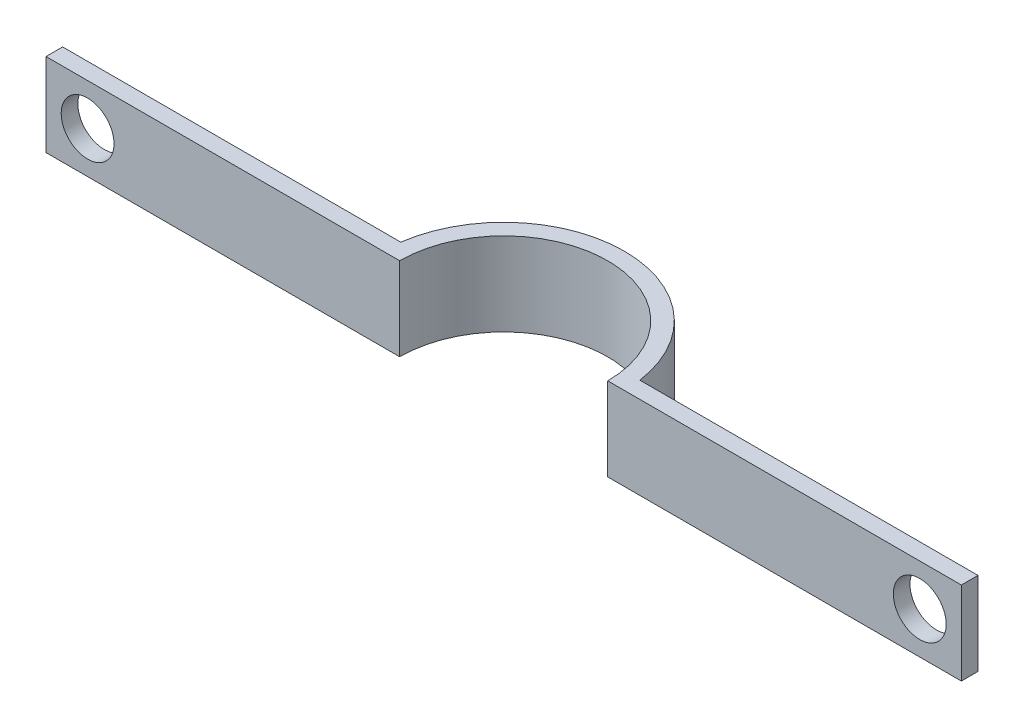
ISO-10303-21;
HEADER;
FILE_DESCRIPTION(('STEP AP214'),'2;1');
FILE_NAME('part.step','',(''),(''),'','','');
FILE_SCHEMA(('AUTOMOTIVE_DESIGN { 1 0 10303 214 1 1 1 1 }'));
ENDSEC;
DATA;
#1=APPLICATION_CONTEXT('core data for automotive mechanical design processes');
#2=APPLICATION_PROTOCOL_DEFINITION('international standard','automotive_design',2000,#1);
#3=PRODUCT_CONTEXT('',#1,'mechanical');
#4=PRODUCT('Part','Part','',(#3));
#5=PRODUCT_RELATED_PRODUCT_CATEGORY('part','',(#4));
#6=PRODUCT_DEFINITION_FORMATION('','',#4);
#7=PRODUCT_DEFINITION_CONTEXT('part definition',#1,'design');
#8=PRODUCT_DEFINITION('design','',#6,#7);
#9=PRODUCT_DEFINITION_SHAPE('','',#8);
#10=(LENGTH_UNIT() NAMED_UNIT(*) SI_UNIT(.MILLI.,.METRE.));
#11=(NAMED_UNIT(*) PLANE_ANGLE_UNIT() SI_UNIT($,.RADIAN.));
#12=(NAMED_UNIT(*) SI_UNIT($,.STERADIAN.) SOLID_ANGLE_UNIT());
#13=UNCERTAINTY_MEASURE_WITH_UNIT(LENGTH_MEASURE(1.E-05),#10,'distance_accuracy_value','');
#14=(GEOMETRIC_REPRESENTATION_CONTEXT(3) GLOBAL_UNCERTAINTY_ASSIGNED_CONTEXT((#13)) GLOBAL_UNIT_ASSIGNED_CONTEXT((#10,
#11,#12)) REPRESENTATION_CONTEXT('',''));
#15=CARTESIAN_POINT('',(0.,0.,0.));
#16=DIRECTION('',(0.,0.,1.));
#17=DIRECTION('',(1.,0.,0.));
#18=AXIS2_PLACEMENT_3D('',#15,#16,#17);
#19=CARTESIAN_POINT('',(220.,15.,11.2649567794205));
#20=DIRECTION('',(0.,0.,1.));
#21=DIRECTION('',(1.,0.,0.));
#22=AXIS2_PLACEMENT_3D('',#19,#20,#21);
#23=PLANE('',#22);
#24=DIRECTION('',(0.,-1.,0.));
#25=VECTOR('',#24,1.);
#26=CARTESIAN_POINT('',(-50.,-25.,11.2649567794205));
#27=LINE('',#26,#25);
#28=CARTESIAN_POINT('',(-50.,15.,11.2649567794205));
#29=VERTEX_POINT('',#28);
#30=CARTESIAN_POINT('',(-50.,-25.,11.2649567794205));
#31=VERTEX_POINT('',#30);
#32=EDGE_CURVE('E11',#29,#31,#27,.T.);
#33=ORIENTED_EDGE('',*,*,#32,.F.);
#34=DIRECTION('',(-1.,0.,0.));
#35=VECTOR('',#34,1.);
#36=CARTESIAN_POINT('',(220.,15.,11.2649567794205));
#37=LINE('',#36,#35);
#38=CARTESIAN_POINT('',(-220.,15.,11.2649567794205));
#39=VERTEX_POINT('',#38);
#40=EDGE_CURVE('E177',#29,#39,#37,.T.);
#41=ORIENTED_EDGE('',*,*,#40,.T.);
#42=DIRECTION('',(0.,-1.,0.));
#43=VECTOR('',#42,1.);
#44=CARTESIAN_POINT('',(-220.,15.,11.2649567794205));
#45=LINE('',#44,#43);
#46=CARTESIAN_POINT('',(-220.,-25.,11.2649567794205));
#47=VERTEX_POINT('',#46);
#48=EDGE_CURVE('E157',#39,#47,#45,.T.);
#49=ORIENTED_EDGE('',*,*,#48,.T.);
#50=DIRECTION('',(-1.,0.,0.));
#51=VECTOR('',#50,1.);
#52=CARTESIAN_POINT('',(220.,-25.,11.2649567794205));
#53=LINE('',#52,#51);
#54=EDGE_CURVE('E138',#31,#47,#53,.T.);
#55=ORIENTED_EDGE('',*,*,#54,.F.);
#56=EDGE_LOOP('',(#33,#41,#49,#55));
#57=FACE_BOUND('',#56,.T.);
#58=CARTESIAN_POINT('',(-200.,-5.00000000000001,11.2649567794206));
#59=DIRECTION('',(0.,0.,-1.));
#60=DIRECTION('',(-1.,0.,0.));
#61=AXIS2_PLACEMENT_3D('',#58,#59,#60);
#62=CIRCLE('',#61,12.7);
#63=CARTESIAN_POINT('',(-212.7,-5.00000000000001,11.2649567794206));
#64=VERTEX_POINT('',#63);
#65=EDGE_CURVE('E139',#64,#64,#62,.T.);
#66=ORIENTED_EDGE('',*,*,#65,.T.);
#67=EDGE_LOOP('',(#66));
#68=FACE_BOUND('',#67,.T.);
#69=ADVANCED_FACE('F35',(#57,#68),#23,.T.);
#70=CARTESIAN_POINT('',(220.,15.,3.26495677942058));
#71=DIRECTION('',(1.,0.,0.));
#72=DIRECTION('',(0.,0.,-1.));
#73=AXIS2_PLACEMENT_3D('',#70,#71,#72);
#74=PLANE('',#73);
#75=DIRECTION('',(0.,0.,1.));
#76=VECTOR('',#75,1.);
#77=CARTESIAN_POINT('',(220.,-25.,3.26495677942058));
#78=LINE('',#77,#76);
#79=CARTESIAN_POINT('',(220.,-25.,3.26495677942058));
#80=VERTEX_POINT('',#79);
#81=CARTESIAN_POINT('',(220.,-25.,11.2649567794205));
#82=VERTEX_POINT('',#81);
#83=EDGE_CURVE('E135',#80,#82,#78,.T.);
#84=ORIENTED_EDGE('',*,*,#83,.F.);
#85=DIRECTION('',(0.,-1.,0.));
#86=VECTOR('',#85,1.);
#87=CARTESIAN_POINT('',(220.,15.,3.26495677942058));
#88=LINE('',#87,#86);
#89=CARTESIAN_POINT('',(220.,15.,3.26495677942058));
#90=VERTEX_POINT('',#89);
#91=EDGE_CURVE('E58',#90,#80,#88,.T.);
#92=ORIENTED_EDGE('',*,*,#91,.F.);
#93=DIRECTION('',(0.,0.,1.));
#94=VECTOR('',#93,1.);
#95=CARTESIAN_POINT('',(220.,15.,3.26495677942058));
#96=LINE('',#95,#94);
#97=CARTESIAN_POINT('',(220.,15.,11.2649567794205));
#98=VERTEX_POINT('',#97);
#99=EDGE_CURVE('E152',#90,#98,#96,.T.);
#100=ORIENTED_EDGE('',*,*,#99,.T.);
#101=DIRECTION('',(0.,-1.,0.));
#102=VECTOR('',#101,1.);
#103=CARTESIAN_POINT('',(220.,15.,11.2649567794205));
#104=LINE('',#103,#102);
#105=EDGE_CURVE('E91',#98,#82,#104,.T.);
#106=ORIENTED_EDGE('',*,*,#105,.T.);
#107=EDGE_LOOP('',(#84,#92,#100,#106));
#108=FACE_BOUND('',#107,.T.);
#109=ADVANCED_FACE('F37',(#108),#74,.T.);
#110=CARTESIAN_POINT('',(57.4456264653803,15.,3.26495677942055));
#111=DIRECTION('',(0.,0.,-1.));
#112=DIRECTION('',(-1.,0.,0.));
#113=AXIS2_PLACEMENT_3D('',#110,#111,#112);
#114=PLANE('',#113);
#115=CARTESIAN_POINT('',(200.,-5.,3.26495677942057));
#116=DIRECTION('',(0.,0.,-1.));
#117=DIRECTION('',(-1.,0.,0.));
#118=AXIS2_PLACEMENT_3D('',#115,#116,#117);
#119=CIRCLE('',#118,12.7);
#120=CARTESIAN_POINT('',(187.3,-5.,3.26495677942057));
#121=VERTEX_POINT('',#120);
#122=EDGE_CURVE('E166',#121,#121,#119,.T.);
#123=ORIENTED_EDGE('',*,*,#122,.F.);
#124=EDGE_LOOP('',(#123));
#125=FACE_BOUND('',#124,.T.);
#126=DIRECTION('',(1.,0.,0.));
#127=VECTOR('',#126,1.);
#128=CARTESIAN_POINT('',(57.4456264653803,-25.,3.26495677942055));
#129=LINE('',#128,#127);
#130=CARTESIAN_POINT('',(57.4456264653803,-25.,3.26495677942053));
#131=VERTEX_POINT('',#130);
#132=EDGE_CURVE('E149',#131,#80,#129,.T.);
#133=ORIENTED_EDGE('',*,*,#132,.F.);
#134=DIRECTION('',(0.,-1.,0.));
#135=VECTOR('',#134,1.);
#136=CARTESIAN_POINT('',(57.4456264653803,15.,3.26495677942053));
#137=LINE('',#136,#135);
#138=CARTESIAN_POINT('',(57.4456264653803,15.,3.26495677942053));
#139=VERTEX_POINT('',#138);
#140=EDGE_CURVE('E115',#139,#131,#137,.T.);
#141=ORIENTED_EDGE('',*,*,#140,.F.);
#142=DIRECTION('',(1.,0.,0.));
#143=VECTOR('',#142,1.);
#144=CARTESIAN_POINT('',(57.4456264653803,15.,3.26495677942055));
#145=LINE('',#144,#143);
#146=EDGE_CURVE('E125',#139,#90,#145,.T.);
#147=ORIENTED_EDGE('',*,*,#146,.T.);
#148=ORIENTED_EDGE('',*,*,#91,.T.);
#149=EDGE_LOOP('',(#133,#141,#147,#148));
#150=FACE_BOUND('',#149,.T.);
#151=ADVANCED_FACE('F193',(#125,#150),#114,.T.);
#152=CARTESIAN_POINT('',(0.,15.,11.2649567794205));
#153=DIRECTION('',(0.,-1.,0.));
#154=DIRECTION('',(0.,0.,-1.));
#155=AXIS2_PLACEMENT_3D('',#152,#153,#154);
#156=CYLINDRICAL_SURFACE('',#155,58.);
#157=CARTESIAN_POINT('',(0.,-25.,11.2649567794205));
#158=DIRECTION('',(0.,-1.,0.));
#159=DIRECTION('',(0.,0.,-1.));
#160=AXIS2_PLACEMENT_3D('',#157,#158,#159);
#161=CIRCLE('',#160,58.);
#162=CARTESIAN_POINT('',(-57.4456264653803,-25.,3.26495677942058));
#163=VERTEX_POINT('',#162);
#164=EDGE_CURVE('E110',#163,#131,#161,.T.);
#165=ORIENTED_EDGE('',*,*,#164,.F.);
#166=DIRECTION('',(0.,-1.,0.));
#167=VECTOR('',#166,1.);
#168=CARTESIAN_POINT('',(-57.4456264653803,15.,3.26495677942058));
#169=LINE('',#168,#167);
#170=CARTESIAN_POINT('',(-57.4456264653803,15.,3.26495677942058));
#171=VERTEX_POINT('',#170);
#172=EDGE_CURVE('E104',#171,#163,#169,.T.);
#173=ORIENTED_EDGE('',*,*,#172,.F.);
#174=CARTESIAN_POINT('',(0.,15.,11.2649567794205));
#175=DIRECTION('',(0.,-1.,0.));
#176=DIRECTION('',(0.,0.,-1.));
#177=AXIS2_PLACEMENT_3D('',#174,#175,#176);
#178=CIRCLE('',#177,58.);
#179=EDGE_CURVE('E107',#171,#139,#178,.T.);
#180=ORIENTED_EDGE('',*,*,#179,.T.);
#181=ORIENTED_EDGE('',*,*,#140,.T.);
#182=EDGE_LOOP('',(#165,#173,#180,#181));
#183=FACE_BOUND('',#182,.T.);
#184=ADVANCED_FACE('F106',(#183),#156,.T.);
#185=CARTESIAN_POINT('',(-220.,15.,3.26495677942055));
#186=DIRECTION('',(0.,0.,-1.));
#187=DIRECTION('',(-1.,0.,0.));
#188=AXIS2_PLACEMENT_3D('',#185,#186,#187);
#189=PLANE('',#188);
#190=CARTESIAN_POINT('',(-200.,-5.00000000000001,3.26495677942049));
#191=DIRECTION('',(0.,0.,-1.));
#192=DIRECTION('',(-1.,0.,0.));
#193=AXIS2_PLACEMENT_3D('',#190,#191,#192);
#194=CIRCLE('',#193,12.7);
#195=CARTESIAN_POINT('',(-212.7,-5.00000000000001,3.26495677942049));
#196=VERTEX_POINT('',#195);
#197=EDGE_CURVE('E172',#196,#196,#194,.T.);
#198=ORIENTED_EDGE('',*,*,#197,.F.);
#199=EDGE_LOOP('',(#198));
#200=FACE_BOUND('',#199,.T.);
#201=DIRECTION('',(1.,0.,0.));
#202=VECTOR('',#201,1.);
#203=CARTESIAN_POINT('',(-220.,-25.,3.26495677942055));
#204=LINE('',#203,#202);
#205=CARTESIAN_POINT('',(-220.,-25.,3.26495677942055));
#206=VERTEX_POINT('',#205);
#207=EDGE_CURVE('E146',#206,#163,#204,.T.);
#208=ORIENTED_EDGE('',*,*,#207,.F.);
#209=DIRECTION('',(0.,-1.,0.));
#210=VECTOR('',#209,1.);
#211=CARTESIAN_POINT('',(-220.,15.,3.26495677942055));
#212=LINE('',#211,#210);
#213=CARTESIAN_POINT('',(-220.,15.,3.26495677942055));
#214=VERTEX_POINT('',#213);
#215=EDGE_CURVE('E116',#214,#206,#212,.T.);
#216=ORIENTED_EDGE('',*,*,#215,.F.);
#217=DIRECTION('',(1.,0.,0.));
#218=VECTOR('',#217,1.);
#219=CARTESIAN_POINT('',(-220.,15.,3.26495677942055));
#220=LINE('',#219,#218);
#221=EDGE_CURVE('E123',#214,#171,#220,.T.);
#222=ORIENTED_EDGE('',*,*,#221,.T.);
#223=ORIENTED_EDGE('',*,*,#172,.T.);
#224=EDGE_LOOP('',(#208,#216,#222,#223));
#225=FACE_BOUND('',#224,.T.);
#226=ADVANCED_FACE('F127',(#200,#225),#189,.T.);
#227=CARTESIAN_POINT('',(-220.,15.,11.2649567794205));
#228=DIRECTION('',(-1.,0.,0.));
#229=DIRECTION('',(0.,0.,1.));
#230=AXIS2_PLACEMENT_3D('',#227,#228,#229);
#231=PLANE('',#230);
#232=DIRECTION('',(0.,0.,-1.));
#233=VECTOR('',#232,1.);
#234=CARTESIAN_POINT('',(-220.,-25.,11.2649567794205));
#235=LINE('',#234,#233);
#236=EDGE_CURVE('E143',#47,#206,#235,.T.);
#237=ORIENTED_EDGE('',*,*,#236,.F.);
#238=ORIENTED_EDGE('',*,*,#48,.F.);
#239=DIRECTION('',(0.,0.,-1.));
#240=VECTOR('',#239,1.);
#241=CARTESIAN_POINT('',(-220.,15.,11.2649567794205));
#242=LINE('',#241,#240);
#243=EDGE_CURVE('E128',#39,#214,#242,.T.);
#244=ORIENTED_EDGE('',*,*,#243,.T.);
#245=ORIENTED_EDGE('',*,*,#215,.T.);
#246=EDGE_LOOP('',(#237,#238,#244,#245));
#247=FACE_BOUND('',#246,.T.);
#248=ADVANCED_FACE('F186',(#247),#231,.T.);
#249=DIRECTION('',(0.,-1.,0.));
#250=VECTOR('',#249,1.);
#251=CARTESIAN_POINT('',(50.,-25.,11.2649567794205));
#252=LINE('',#251,#250);
#253=CARTESIAN_POINT('',(50.,-25.,11.2649567794205));
#254=VERTEX_POINT('',#253);
#255=CARTESIAN_POINT('',(50.,15.,11.2649567794205));
#256=VERTEX_POINT('',#255);
#257=EDGE_CURVE('E43',#254,#256,#252,.F.);
#258=ORIENTED_EDGE('',*,*,#257,.F.);
#259=EDGE_CURVE('E140',#82,#254,#53,.T.);
#260=ORIENTED_EDGE('',*,*,#259,.F.);
#261=ORIENTED_EDGE('',*,*,#105,.F.);
#262=EDGE_CURVE('E130',#98,#256,#37,.T.);
#263=ORIENTED_EDGE('',*,*,#262,.T.);
#264=EDGE_LOOP('',(#258,#260,#261,#263));
#265=FACE_BOUND('',#264,.T.);
#266=CARTESIAN_POINT('',(200.,-5.,11.2649567794206));
#267=DIRECTION('',(0.,0.,-1.));
#268=DIRECTION('',(-1.,0.,0.));
#269=AXIS2_PLACEMENT_3D('',#266,#267,#268);
#270=CIRCLE('',#269,12.7);
#271=CARTESIAN_POINT('',(187.3,-5.,11.2649567794206));
#272=VERTEX_POINT('',#271);
#273=EDGE_CURVE('E169',#272,#272,#270,.T.);
#274=ORIENTED_EDGE('',*,*,#273,.T.);
#275=EDGE_LOOP('',(#274));
#276=FACE_BOUND('',#275,.T.);
#277=ADVANCED_FACE('F191',(#265,#276),#23,.T.);
#278=CARTESIAN_POINT('',(0.,15.,11.2649567794205));
#279=DIRECTION('',(0.,-1.,0.));
#280=DIRECTION('',(0.,0.,-1.));
#281=AXIS2_PLACEMENT_3D('',#278,#279,#280);
#282=PLANE('',#281);
#283=ORIENTED_EDGE('',*,*,#40,.F.);
#284=CARTESIAN_POINT('',(0.,15.,11.2649567794205));
#285=DIRECTION('',(0.,-1.,0.));
#286=DIRECTION('',(0.,0.,-1.));
#287=AXIS2_PLACEMENT_3D('',#284,#285,#286);
#288=CIRCLE('',#287,50.);
#289=EDGE_CURVE('E154',#29,#256,#288,.T.);
#290=ORIENTED_EDGE('',*,*,#289,.T.);
#291=ORIENTED_EDGE('',*,*,#262,.F.);
#292=ORIENTED_EDGE('',*,*,#99,.F.);
#293=ORIENTED_EDGE('',*,*,#146,.F.);
#294=ORIENTED_EDGE('',*,*,#179,.F.);
#295=ORIENTED_EDGE('',*,*,#221,.F.);
#296=ORIENTED_EDGE('',*,*,#243,.F.);
#297=EDGE_LOOP('',(#283,#290,#291,#292,#293,#294,#295,#296));
#298=FACE_BOUND('',#297,.T.);
#299=ADVANCED_FACE('F121',(#298),#282,.F.);
#300=CARTESIAN_POINT('',(0.,-25.,11.2649567794205));
#301=DIRECTION('',(0.,-1.,0.));
#302=DIRECTION('',(0.,0.,-1.));
#303=AXIS2_PLACEMENT_3D('',#300,#301,#302);
#304=PLANE('',#303);
#305=CARTESIAN_POINT('',(0.,-25.,11.2649567794205));
#306=DIRECTION('',(0.,-1.,0.));
#307=DIRECTION('',(0.,0.,-1.));
#308=AXIS2_PLACEMENT_3D('',#305,#306,#307);
#309=CIRCLE('',#308,50.);
#310=EDGE_CURVE('E160',#31,#254,#309,.T.);
#311=ORIENTED_EDGE('',*,*,#310,.F.);
#312=ORIENTED_EDGE('',*,*,#54,.T.);
#313=ORIENTED_EDGE('',*,*,#236,.T.);
#314=ORIENTED_EDGE('',*,*,#207,.T.);
#315=ORIENTED_EDGE('',*,*,#164,.T.);
#316=ORIENTED_EDGE('',*,*,#132,.T.);
#317=ORIENTED_EDGE('',*,*,#83,.T.);
#318=ORIENTED_EDGE('',*,*,#259,.T.);
#319=EDGE_LOOP('',(#311,#312,#313,#314,#315,#316,#317,#318));
#320=FACE_BOUND('',#319,.T.);
#321=ADVANCED_FACE('F188',(#320),#304,.T.);
#322=CARTESIAN_POINT('',(-200.,-5.00000000000001,3.26495677942049));
#323=DIRECTION('',(0.,0.,-1.));
#324=DIRECTION('',(-1.,0.,0.));
#325=AXIS2_PLACEMENT_3D('',#322,#323,#324);
#326=CYLINDRICAL_SURFACE('',#325,12.7);
#327=ORIENTED_EDGE('',*,*,#65,.F.);
#328=EDGE_LOOP('',(#327));
#329=FACE_BOUND('',#328,.T.);
#330=ORIENTED_EDGE('',*,*,#197,.T.);
#331=EDGE_LOOP('',(#330));
#332=FACE_BOUND('',#331,.T.);
#333=ADVANCED_FACE('F223',(#329,#332),#326,.F.);
#334=CARTESIAN_POINT('',(200.,-5.,3.26495677942058));
#335=DIRECTION('',(0.,0.,-1.));
#336=DIRECTION('',(-1.,0.,0.));
#337=AXIS2_PLACEMENT_3D('',#334,#335,#336);
#338=CYLINDRICAL_SURFACE('',#337,12.7);
#339=ORIENTED_EDGE('',*,*,#273,.F.);
#340=EDGE_LOOP('',(#339));
#341=FACE_BOUND('',#340,.T.);
#342=ORIENTED_EDGE('',*,*,#122,.T.);
#343=EDGE_LOOP('',(#342));
#344=FACE_BOUND('',#343,.T.);
#345=ADVANCED_FACE('F225',(#341,#344),#338,.F.);
#346=CARTESIAN_POINT('',(0.,-25.,11.2649567794205));
#347=DIRECTION('',(0.,-1.,0.));
#348=DIRECTION('',(0.,0.,-1.));
#349=AXIS2_PLACEMENT_3D('',#346,#347,#348);
#350=CYLINDRICAL_SURFACE('',#349,50.);
#351=ORIENTED_EDGE('',*,*,#32,.T.);
#352=ORIENTED_EDGE('',*,*,#310,.T.);
#353=ORIENTED_EDGE('',*,*,#257,.T.);
#354=ORIENTED_EDGE('',*,*,#289,.F.);
#355=EDGE_LOOP('',(#351,#352,#353,#354));
#356=FACE_BOUND('',#355,.T.);
#357=ADVANCED_FACE('F190',(#356),#350,.F.);
#358=CLOSED_SHELL('',(#69,#109,#151,#184,#226,#248,#277,#299,#321,#333,#345,#357));
#359=MANIFOLD_SOLID_BREP('B2',#358);
#360=ADVANCED_BREP_SHAPE_REPRESENTATION('',(#18,#359),#14);
#361=SHAPE_DEFINITION_REPRESENTATION(#9,#360);
ENDSEC;
END-ISO-10303-21;
